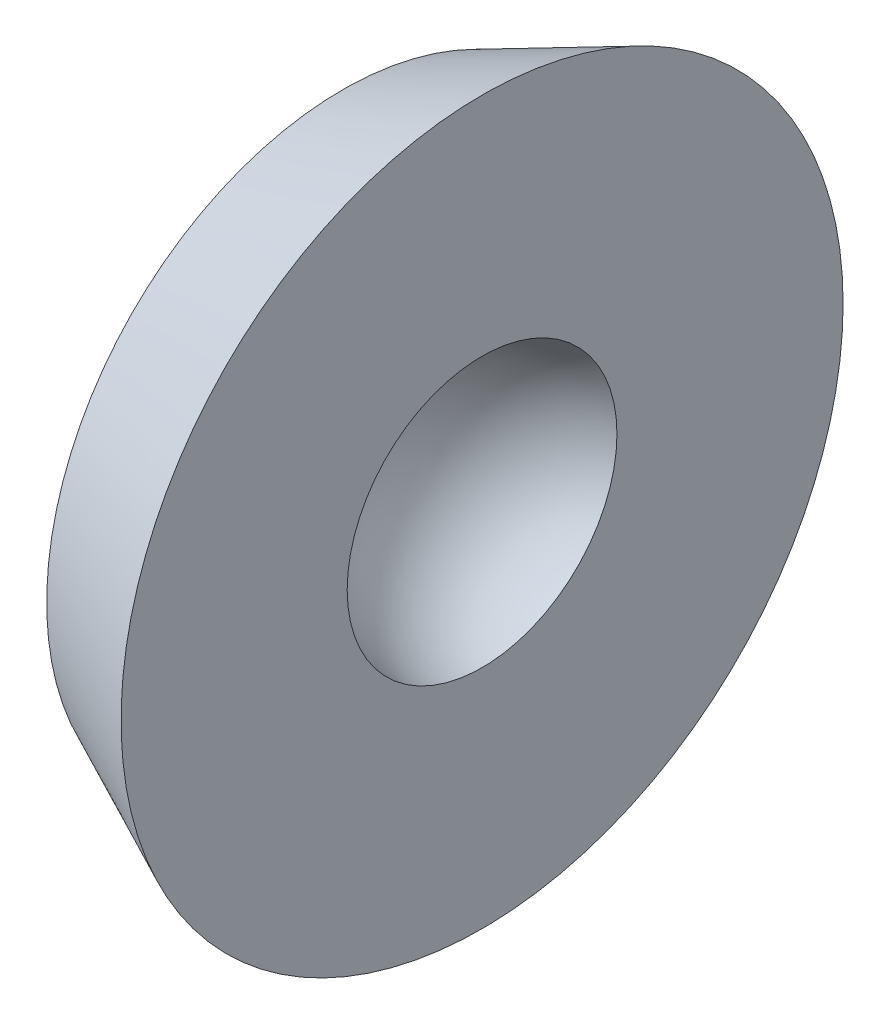
ISO-10303-21;
HEADER;
FILE_DESCRIPTION(('STEP AP214'),'2;1');
FILE_NAME('part.step','',(''),(''),'','','');
FILE_SCHEMA(('AUTOMOTIVE_DESIGN { 1 0 10303 214 1 1 1 1 }'));
ENDSEC;
DATA;
#1=APPLICATION_CONTEXT('core data for automotive mechanical design processes');
#2=APPLICATION_PROTOCOL_DEFINITION('international standard','automotive_design',2000,#1);
#3=PRODUCT_CONTEXT('',#1,'mechanical');
#4=PRODUCT('Part','Part','',(#3));
#5=PRODUCT_RELATED_PRODUCT_CATEGORY('part','',(#4));
#6=PRODUCT_DEFINITION_FORMATION('','',#4);
#7=PRODUCT_DEFINITION_CONTEXT('part definition',#1,'design');
#8=PRODUCT_DEFINITION('design','',#6,#7);
#9=PRODUCT_DEFINITION_SHAPE('','',#8);
#10=(LENGTH_UNIT() NAMED_UNIT(*) SI_UNIT(.MILLI.,.METRE.));
#11=(NAMED_UNIT(*) PLANE_ANGLE_UNIT() SI_UNIT($,.RADIAN.));
#12=(NAMED_UNIT(*) SI_UNIT($,.STERADIAN.) SOLID_ANGLE_UNIT());
#13=UNCERTAINTY_MEASURE_WITH_UNIT(LENGTH_MEASURE(1.E-05),#10,'distance_accuracy_value','');
#14=(GEOMETRIC_REPRESENTATION_CONTEXT(3) GLOBAL_UNCERTAINTY_ASSIGNED_CONTEXT((#13)) GLOBAL_UNIT_ASSIGNED_CONTEXT((#10,
#11,#12)) REPRESENTATION_CONTEXT('',''));
#15=CARTESIAN_POINT('',(0.,0.,0.));
#16=DIRECTION('',(0.,0.,1.));
#17=DIRECTION('',(1.,0.,0.));
#18=AXIS2_PLACEMENT_3D('',#15,#16,#17);
#19=CARTESIAN_POINT('',(0.,0.,0.));
#20=DIRECTION('',(1.,0.,0.));
#21=DIRECTION('',(0.,0.,-1.));
#22=AXIS2_PLACEMENT_3D('',#19,#20,#21);
#23=CONICAL_SURFACE('',#22,4.25,0.436332312998583);
#24=CARTESIAN_POINT('',(2.,0.,0.));
#25=DIRECTION('',(1.,0.,0.));
#26=DIRECTION('',(0.,0.,-1.));
#27=AXIS2_PLACEMENT_3D('',#24,#25,#26);
#28=CIRCLE('',#27,5.18261531631);
#29=CARTESIAN_POINT('',(2.,0.,-5.18261531631));
#30=VERTEX_POINT('',#29);
#31=EDGE_CURVE('E10',#30,#30,#28,.T.);
#32=ORIENTED_EDGE('',*,*,#31,.F.);
#33=EDGE_LOOP('',(#32));
#34=FACE_BOUND('',#33,.T.);
#35=CARTESIAN_POINT('',(0.,0.,0.));
#36=DIRECTION('',(1.,0.,0.));
#37=DIRECTION('',(0.,0.,-1.));
#38=AXIS2_PLACEMENT_3D('',#35,#36,#37);
#39=CIRCLE('',#38,4.25);
#40=CARTESIAN_POINT('',(0.,0.,-4.25));
#41=VERTEX_POINT('',#40);
#42=EDGE_CURVE('E38',#41,#41,#39,.T.);
#43=ORIENTED_EDGE('',*,*,#42,.T.);
#44=EDGE_LOOP('',(#43));
#45=FACE_BOUND('',#44,.T.);
#46=ADVANCED_FACE('F32',(#34,#45),#23,.T.);
#47=CARTESIAN_POINT('',(2.,0.,0.));
#48=DIRECTION('',(1.,0.,0.));
#49=DIRECTION('',(0.,0.,-1.));
#50=AXIS2_PLACEMENT_3D('',#47,#48,#49);
#51=PLANE('',#50);
#52=CARTESIAN_POINT('',(2.,0.,0.));
#53=DIRECTION('',(-1.,0.,0.));
#54=DIRECTION('',(0.,0.,1.));
#55=AXIS2_PLACEMENT_3D('',#52,#53,#54);
#56=CIRCLE('',#55,1.93649167310371);
#57=CARTESIAN_POINT('',(2.,0.,1.93649167310371));
#58=VERTEX_POINT('',#57);
#59=EDGE_CURVE('E42',#58,#58,#56,.T.);
#60=ORIENTED_EDGE('',*,*,#59,.T.);
#61=EDGE_LOOP('',(#60));
#62=FACE_BOUND('',#61,.T.);
#63=ORIENTED_EDGE('',*,*,#31,.T.);
#64=EDGE_LOOP('',(#63));
#65=FACE_BOUND('',#64,.T.);
#66=ADVANCED_FACE('F49',(#62,#65),#51,.T.);
#67=CARTESIAN_POINT('',(0.,0.,0.));
#68=DIRECTION('',(1.,0.,0.));
#69=DIRECTION('',(0.,0.,-1.));
#70=AXIS2_PLACEMENT_3D('',#67,#68,#69);
#71=PLANE('',#70);
#72=ORIENTED_EDGE('',*,*,#42,.F.);
#73=EDGE_LOOP('',(#72));
#74=FACE_BOUND('',#73,.T.);
#75=ADVANCED_FACE('F53',(#74),#71,.F.);
#76=CARTESIAN_POINT('',(2.5,0.,0.));
#77=DIRECTION('',(-1.,0.,0.));
#78=DIRECTION('',(0.,0.,-1.));
#79=AXIS2_PLACEMENT_3D('',#76,#77,#78);
#80=SPHERICAL_SURFACE('',#79,2.);
#81=ORIENTED_EDGE('',*,*,#59,.F.);
#82=EDGE_LOOP('',(#81));
#83=FACE_BOUND('',#82,.T.);
#84=ADVANCED_FACE('F51',(#83),#80,.F.);
#85=CLOSED_SHELL('',(#46,#66,#75,#84));
#86=MANIFOLD_SOLID_BREP('B2',#85);
#87=ADVANCED_BREP_SHAPE_REPRESENTATION('',(#18,#86),#14);
#88=SHAPE_DEFINITION_REPRESENTATION(#9,#87);
ENDSEC;
END-ISO-10303-21;
